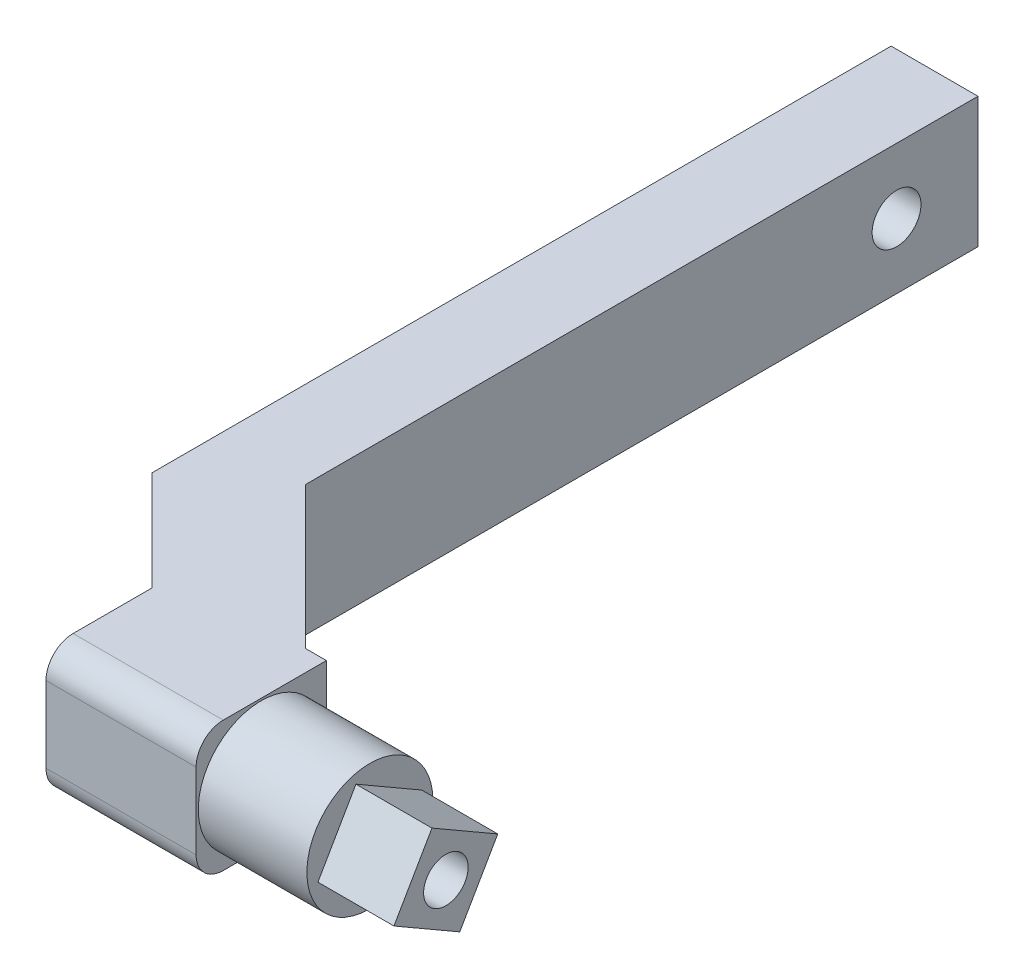
ISO-10303-21;
HEADER;
FILE_DESCRIPTION(('STEP AP214'),'2;1');
FILE_NAME('part.step','',(''),(''),'','','');
FILE_SCHEMA(('AUTOMOTIVE_DESIGN { 1 0 10303 214 1 1 1 1 }'));
ENDSEC;
DATA;
#1=APPLICATION_CONTEXT('core data for automotive mechanical design processes');
#2=APPLICATION_PROTOCOL_DEFINITION('international standard','automotive_design',2000,#1);
#3=PRODUCT_CONTEXT('',#1,'mechanical');
#4=PRODUCT('Part','Part','',(#3));
#5=PRODUCT_RELATED_PRODUCT_CATEGORY('part','',(#4));
#6=PRODUCT_DEFINITION_FORMATION('','',#4);
#7=PRODUCT_DEFINITION_CONTEXT('part definition',#1,'design');
#8=PRODUCT_DEFINITION('design','',#6,#7);
#9=PRODUCT_DEFINITION_SHAPE('','',#8);
#10=(LENGTH_UNIT() NAMED_UNIT(*) SI_UNIT(.MILLI.,.METRE.));
#11=(NAMED_UNIT(*) PLANE_ANGLE_UNIT() SI_UNIT($,.RADIAN.));
#12=(NAMED_UNIT(*) SI_UNIT($,.STERADIAN.) SOLID_ANGLE_UNIT());
#13=UNCERTAINTY_MEASURE_WITH_UNIT(LENGTH_MEASURE(1.E-05),#10,'distance_accuracy_value','');
#14=(GEOMETRIC_REPRESENTATION_CONTEXT(3) GLOBAL_UNCERTAINTY_ASSIGNED_CONTEXT((#13)) GLOBAL_UNIT_ASSIGNED_CONTEXT((#10,
#11,#12)) REPRESENTATION_CONTEXT('',''));
#15=CARTESIAN_POINT('',(0.,0.,0.));
#16=DIRECTION('',(0.,0.,1.));
#17=DIRECTION('',(1.,0.,0.));
#18=AXIS2_PLACEMENT_3D('',#15,#16,#17);
#19=CARTESIAN_POINT('',(14.,24.,0.));
#20=DIRECTION('',(-1.,0.,0.));
#21=DIRECTION('',(0.,0.,1.));
#22=AXIS2_PLACEMENT_3D('',#19,#20,#21);
#23=PLANE('',#22);
#24=CARTESIAN_POINT('',(14.,12.,2.14213562373101));
#25=DIRECTION('',(1.,0.,0.));
#26=DIRECTION('',(0.,0.,-1.));
#27=AXIS2_PLACEMENT_3D('',#24,#25,#26);
#28=CIRCLE('',#27,11.6);
#29=CARTESIAN_POINT('',(14.,12.,-9.45786437626898));
#30=VERTEX_POINT('',#29);
#31=EDGE_CURVE('E167',#30,#30,#28,.T.);
#32=ORIENTED_EDGE('',*,*,#31,.T.);
#33=EDGE_LOOP('',(#32));
#34=FACE_BOUND('',#33,.T.);
#35=DIRECTION('',(0.,0.500000000000003,0.866025403784437));
#36=VECTOR('',#35,1.);
#37=CARTESIAN_POINT('',(14.,21.5621778264911,4.70431345022204));
#38=LINE('',#37,#36);
#39=CARTESIAN_POINT('',(14.,14.562177826491,-7.42004220276007));
#40=VERTEX_POINT('',#39);
#41=CARTESIAN_POINT('',(14.,21.5621778264911,4.70431345022204));
#42=VERTEX_POINT('',#41);
#43=EDGE_CURVE('E163',#40,#42,#38,.T.);
#44=ORIENTED_EDGE('',*,*,#43,.F.);
#45=DIRECTION('',(0.,0.866025403784436,-0.500000000000004));
#46=VECTOR('',#45,1.);
#47=CARTESIAN_POINT('',(14.,14.562177826491,-7.42004220276007));
#48=LINE('',#47,#46);
#49=CARTESIAN_POINT('',(14.,2.43782217350892,-0.420042202760013));
#50=VERTEX_POINT('',#49);
#51=EDGE_CURVE('E160',#50,#40,#48,.T.);
#52=ORIENTED_EDGE('',*,*,#51,.F.);
#53=DIRECTION('',(0.,-0.500000000000004,-0.866025403784436));
#54=VECTOR('',#53,1.);
#55=CARTESIAN_POINT('',(14.,9.43782217350897,11.7043134502221));
#56=LINE('',#55,#54);
#57=CARTESIAN_POINT('',(14.,9.43782217350899,11.7043134502221));
#58=VERTEX_POINT('',#57);
#59=EDGE_CURVE('E56',#58,#50,#56,.T.);
#60=ORIENTED_EDGE('',*,*,#59,.F.);
#61=DIRECTION('',(0.,-0.866025403784436,0.500000000000004));
#62=VECTOR('',#61,1.);
#63=CARTESIAN_POINT('',(14.,21.5621778264911,4.70431345022204));
#64=LINE('',#63,#62);
#65=EDGE_CURVE('E51',#42,#58,#64,.T.);
#66=ORIENTED_EDGE('',*,*,#65,.F.);
#67=EDGE_LOOP('',(#44,#52,#60,#66));
#68=FACE_BOUND('',#67,.T.);
#69=ADVANCED_FACE('F35',(#34,#68),#23,.F.);
#70=CARTESIAN_POINT('',(-5.98849367254463E-13,24.,14.1421356237333));
#71=DIRECTION('',(0.,0.,-1.));
#72=DIRECTION('',(-1.,0.,0.));
#73=AXIS2_PLACEMENT_3D('',#70,#71,#72);
#74=PLANE('',#73);
#75=DIRECTION('',(0.,-1.,0.));
#76=VECTOR('',#75,1.);
#77=CARTESIAN_POINT('',(-33.6421356237309,24.,14.1421356237318));
#78=LINE('',#77,#76);
#79=CARTESIAN_POINT('',(-33.6421356237309,19.,14.1421356237318));
#80=VERTEX_POINT('',#79);
#81=CARTESIAN_POINT('',(-33.6421356237309,5.,14.1421356237318));
#82=VERTEX_POINT('',#81);
#83=EDGE_CURVE('E209',#80,#82,#78,.T.);
#84=ORIENTED_EDGE('',*,*,#83,.T.);
#85=DIRECTION('',(1.,0.,0.));
#86=VECTOR('',#85,1.);
#87=CARTESIAN_POINT('',(-5.98849367254463E-13,5.,14.1421356237333));
#88=LINE('',#87,#86);
#89=CARTESIAN_POINT('',(-6.,5.,14.142135623731));
#90=VERTEX_POINT('',#89);
#91=EDGE_CURVE('E245',#82,#90,#88,.T.);
#92=ORIENTED_EDGE('',*,*,#91,.T.);
#93=DIRECTION('',(0.,-1.,0.));
#94=VECTOR('',#93,1.);
#95=CARTESIAN_POINT('',(-6.,0.,14.142135623731));
#96=LINE('',#95,#94);
#97=CARTESIAN_POINT('',(-6.,19.,14.142135623731));
#98=VERTEX_POINT('',#97);
#99=EDGE_CURVE('E176',#98,#90,#96,.T.);
#100=ORIENTED_EDGE('',*,*,#99,.F.);
#101=DIRECTION('',(1.,0.,0.));
#102=VECTOR('',#101,1.);
#103=CARTESIAN_POINT('',(-33.6421356237309,19.,14.1421356237318));
#104=LINE('',#103,#102);
#105=EDGE_CURVE('E243',#98,#80,#104,.F.);
#106=ORIENTED_EDGE('',*,*,#105,.T.);
#107=EDGE_LOOP('',(#84,#92,#100,#106));
#108=FACE_BOUND('',#107,.T.);
#109=ADVANCED_FACE('F266',(#108),#74,.F.);
#110=CARTESIAN_POINT('',(0.,24.,-9.857864376269));
#111=DIRECTION('',(0.,0.,-1.));
#112=DIRECTION('',(-1.,0.,0.));
#113=AXIS2_PLACEMENT_3D('',#110,#111,#112);
#114=PLANE('',#113);
#115=DIRECTION('',(1.,0.,0.));
#116=VECTOR('',#115,1.);
#117=CARTESIAN_POINT('',(0.,24.,-9.857864376269));
#118=LINE('',#117,#116);
#119=CARTESIAN_POINT('',(-9.85786437626935,24.,-9.857864376269));
#120=VERTEX_POINT('',#119);
#121=CARTESIAN_POINT('',(-5.99999999999997,24.,-9.85786437626902));
#122=VERTEX_POINT('',#121);
#123=EDGE_CURVE('E189',#120,#122,#118,.T.);
#124=ORIENTED_EDGE('',*,*,#123,.T.);
#125=DIRECTION('',(0.,1.,0.));
#126=VECTOR('',#125,1.);
#127=CARTESIAN_POINT('',(-5.99999999999997,0.,-9.85786437626902));
#128=LINE('',#127,#126);
#129=CARTESIAN_POINT('',(-5.99999999999997,0.,-9.85786437626902));
#130=VERTEX_POINT('',#129);
#131=EDGE_CURVE('E181',#130,#122,#128,.T.);
#132=ORIENTED_EDGE('',*,*,#131,.F.);
#133=DIRECTION('',(1.,0.,0.));
#134=VECTOR('',#133,1.);
#135=CARTESIAN_POINT('',(0.,0.,-9.857864376269));
#136=LINE('',#135,#134);
#137=CARTESIAN_POINT('',(-9.85786437626935,0.,-9.857864376269));
#138=VERTEX_POINT('',#137);
#139=EDGE_CURVE('E186',#138,#130,#136,.T.);
#140=ORIENTED_EDGE('',*,*,#139,.F.);
#141=DIRECTION('',(0.,-1.,0.));
#142=VECTOR('',#141,1.);
#143=CARTESIAN_POINT('',(-9.85786437626935,24.,-9.857864376269));
#144=LINE('',#143,#142);
#145=EDGE_CURVE('E241',#120,#138,#144,.T.);
#146=ORIENTED_EDGE('',*,*,#145,.F.);
#147=EDGE_LOOP('',(#124,#132,#140,#146));
#148=FACE_BOUND('',#147,.T.);
#149=ADVANCED_FACE('F280',(#148),#114,.T.);
#150=CARTESIAN_POINT('',(0.,24.,0.));
#151=DIRECTION('',(0.,1.,0.));
#152=DIRECTION('',(0.,0.,1.));
#153=AXIS2_PLACEMENT_3D('',#150,#151,#152);
#154=PLANE('',#153);
#155=DIRECTION('',(0.,0.,1.));
#156=VECTOR('',#155,1.);
#157=CARTESIAN_POINT('',(-33.6421356237305,24.,-8.97843114592054E-13));
#158=LINE('',#157,#156);
#159=CARTESIAN_POINT('',(-33.6421356237304,24.,-5.35786437626736));
#160=VERTEX_POINT('',#159);
#161=CARTESIAN_POINT('',(-33.6421356237308,24.,9.14213562373183));
#162=VERTEX_POINT('',#161);
#163=EDGE_CURVE('E206',#160,#162,#158,.T.);
#164=ORIENTED_EDGE('',*,*,#163,.T.);
#165=DIRECTION('',(1.,0.,0.));
#166=VECTOR('',#165,1.);
#167=CARTESIAN_POINT('',(-5.99999999999979,24.,9.142135623733));
#168=LINE('',#167,#166);
#169=CARTESIAN_POINT('',(-5.99999999999999,24.,9.142135623733));
#170=VERTEX_POINT('',#169);
#171=EDGE_CURVE('E11',#162,#170,#168,.T.);
#172=ORIENTED_EDGE('',*,*,#171,.T.);
#173=DIRECTION('',(0.,0.,1.));
#174=VECTOR('',#173,1.);
#175=CARTESIAN_POINT('',(-5.99999999999998,24.,0.));
#176=LINE('',#175,#174);
#177=EDGE_CURVE('E183',#122,#170,#176,.T.);
#178=ORIENTED_EDGE('',*,*,#177,.F.);
#179=ORIENTED_EDGE('',*,*,#123,.F.);
#180=DIRECTION('',(-0.70710678118656,0.,-0.707106781186535));
#181=VECTOR('',#180,1.);
#182=CARTESIAN_POINT('',(0.,24.,0.));
#183=LINE('',#182,#181);
#184=CARTESIAN_POINT('',(-35.9999999999993,24.,-35.999999999998));
#185=VERTEX_POINT('',#184);
#186=EDGE_CURVE('E192',#120,#185,#183,.T.);
#187=ORIENTED_EDGE('',*,*,#186,.T.);
#188=DIRECTION('',(0.,0.,-1.));
#189=VECTOR('',#188,1.);
#190=CARTESIAN_POINT('',(-35.9999999999993,24.,0.));
#191=LINE('',#190,#189);
#192=CARTESIAN_POINT('',(-35.9999999999993,24.,-159.857864376267));
#193=VERTEX_POINT('',#192);
#194=EDGE_CURVE('E195',#185,#193,#191,.T.);
#195=ORIENTED_EDGE('',*,*,#194,.T.);
#196=DIRECTION('',(1.,0.,0.));
#197=VECTOR('',#196,1.);
#198=CARTESIAN_POINT('',(-2.77309190153028E-13,24.,-159.857864376267));
#199=LINE('',#198,#197);
#200=CARTESIAN_POINT('',(-51.9999999999993,24.,-159.857864376267));
#201=VERTEX_POINT('',#200);
#202=EDGE_CURVE('E197',#201,#193,#199,.T.);
#203=ORIENTED_EDGE('',*,*,#202,.F.);
#204=DIRECTION('',(0.,0.,-1.));
#205=VECTOR('',#204,1.);
#206=CARTESIAN_POINT('',(-51.9999999999992,24.,0.));
#207=LINE('',#206,#205);
#208=CARTESIAN_POINT('',(-51.9999999999992,24.,-23.715728752536));
#209=VERTEX_POINT('',#208);
#210=EDGE_CURVE('E200',#209,#201,#207,.T.);
#211=ORIENTED_EDGE('',*,*,#210,.F.);
#212=DIRECTION('',(-0.707106781186552,0.,-0.707106781186544));
#213=VECTOR('',#212,1.);
#214=CARTESIAN_POINT('',(-14.1421356237313,24.,14.1421356237315));
#215=LINE('',#214,#213);
#216=EDGE_CURVE('E203',#160,#209,#215,.T.);
#217=ORIENTED_EDGE('',*,*,#216,.F.);
#218=EDGE_LOOP('',(#164,#172,#178,#179,#187,#195,#203,#211,#217));
#219=FACE_BOUND('',#218,.T.);
#220=ADVANCED_FACE('F285',(#219),#154,.T.);
#221=CARTESIAN_POINT('',(0.,0.,0.));
#222=DIRECTION('',(0.,1.,0.));
#223=DIRECTION('',(0.,0.,1.));
#224=AXIS2_PLACEMENT_3D('',#221,#222,#223);
#225=PLANE('',#224);
#226=DIRECTION('',(0.,0.,-1.));
#227=VECTOR('',#226,1.);
#228=CARTESIAN_POINT('',(-5.99999999999998,0.,0.));
#229=LINE('',#228,#227);
#230=CARTESIAN_POINT('',(-5.99999999999999,0.,9.142135623733));
#231=VERTEX_POINT('',#230);
#232=EDGE_CURVE('E179',#231,#130,#229,.T.);
#233=ORIENTED_EDGE('',*,*,#232,.F.);
#234=DIRECTION('',(1.,0.,0.));
#235=VECTOR('',#234,1.);
#236=CARTESIAN_POINT('',(-3.87124143007046E-13,0.,9.14213562373326));
#237=LINE('',#236,#235);
#238=CARTESIAN_POINT('',(-33.6421356237308,0.,9.14213562373183));
#239=VERTEX_POINT('',#238);
#240=EDGE_CURVE('E252',#231,#239,#237,.F.);
#241=ORIENTED_EDGE('',*,*,#240,.T.);
#242=DIRECTION('',(0.,0.,1.));
#243=VECTOR('',#242,1.);
#244=CARTESIAN_POINT('',(-33.6421356237305,0.,-8.97843114592054E-13));
#245=LINE('',#244,#243);
#246=CARTESIAN_POINT('',(-33.6421356237304,0.,-5.35786437626736));
#247=VERTEX_POINT('',#246);
#248=EDGE_CURVE('E193',#247,#239,#245,.T.);
#249=ORIENTED_EDGE('',*,*,#248,.F.);
#250=DIRECTION('',(-0.707106781186552,0.,-0.707106781186544));
#251=VECTOR('',#250,1.);
#252=CARTESIAN_POINT('',(-14.1421356237313,0.,14.1421356237315));
#253=LINE('',#252,#251);
#254=CARTESIAN_POINT('',(-51.9999999999992,0.,-23.715728752536));
#255=VERTEX_POINT('',#254);
#256=EDGE_CURVE('E223',#247,#255,#253,.T.);
#257=ORIENTED_EDGE('',*,*,#256,.T.);
#258=DIRECTION('',(0.,0.,-1.));
#259=VECTOR('',#258,1.);
#260=CARTESIAN_POINT('',(-51.9999999999992,0.,0.));
#261=LINE('',#260,#259);
#262=CARTESIAN_POINT('',(-51.9999999999993,0.,-159.857864376267));
#263=VERTEX_POINT('',#262);
#264=EDGE_CURVE('E220',#255,#263,#261,.T.);
#265=ORIENTED_EDGE('',*,*,#264,.T.);
#266=DIRECTION('',(1.,0.,0.));
#267=VECTOR('',#266,1.);
#268=CARTESIAN_POINT('',(-2.77309190153028E-13,0.,-159.857864376267));
#269=LINE('',#268,#267);
#270=CARTESIAN_POINT('',(-35.9999999999993,0.,-159.857864376267));
#271=VERTEX_POINT('',#270);
#272=EDGE_CURVE('E217',#263,#271,#269,.T.);
#273=ORIENTED_EDGE('',*,*,#272,.T.);
#274=DIRECTION('',(0.,0.,-1.));
#275=VECTOR('',#274,1.);
#276=CARTESIAN_POINT('',(-35.9999999999993,0.,0.));
#277=LINE('',#276,#275);
#278=CARTESIAN_POINT('',(-35.9999999999993,0.,-35.999999999998));
#279=VERTEX_POINT('',#278);
#280=EDGE_CURVE('E214',#279,#271,#277,.T.);
#281=ORIENTED_EDGE('',*,*,#280,.F.);
#282=DIRECTION('',(-0.70710678118656,0.,-0.707106781186535));
#283=VECTOR('',#282,1.);
#284=CARTESIAN_POINT('',(0.,0.,0.));
#285=LINE('',#284,#283);
#286=EDGE_CURVE('E212',#138,#279,#285,.T.);
#287=ORIENTED_EDGE('',*,*,#286,.F.);
#288=ORIENTED_EDGE('',*,*,#139,.T.);
#289=EDGE_LOOP('',(#233,#241,#249,#257,#265,#273,#281,#287,#288));
#290=FACE_BOUND('',#289,.T.);
#291=ADVANCED_FACE('F275',(#290),#225,.F.);
#292=CARTESIAN_POINT('',(0.,24.,0.));
#293=DIRECTION('',(-0.707106781186535,0.,0.70710678118656));
#294=DIRECTION('',(0.70710678118656,0.,0.707106781186535));
#295=AXIS2_PLACEMENT_3D('',#292,#293,#294);
#296=PLANE('',#295);
#297=ORIENTED_EDGE('',*,*,#286,.T.);
#298=DIRECTION('',(0.,-1.,0.));
#299=VECTOR('',#298,1.);
#300=CARTESIAN_POINT('',(-35.9999999999993,24.,-35.999999999998));
#301=LINE('',#300,#299);
#302=EDGE_CURVE('E238',#185,#279,#301,.T.);
#303=ORIENTED_EDGE('',*,*,#302,.F.);
#304=ORIENTED_EDGE('',*,*,#186,.F.);
#305=ORIENTED_EDGE('',*,*,#145,.T.);
#306=EDGE_LOOP('',(#297,#303,#304,#305));
#307=FACE_BOUND('',#306,.T.);
#308=ADVANCED_FACE('F307',(#307),#296,.F.);
#309=CARTESIAN_POINT('',(-35.9999999999993,24.,0.));
#310=DIRECTION('',(-1.,0.,0.));
#311=DIRECTION('',(0.,0.,1.));
#312=AXIS2_PLACEMENT_3D('',#309,#310,#311);
#313=PLANE('',#312);
#314=CARTESIAN_POINT('',(-35.9999999999993,12.,-144.857864376268));
#315=DIRECTION('',(-1.,0.,0.));
#316=DIRECTION('',(0.,0.,1.));
#317=AXIS2_PLACEMENT_3D('',#314,#315,#316);
#318=CIRCLE('',#317,4.49999999999999);
#319=CARTESIAN_POINT('',(-35.9999999999993,12.,-140.357864376268));
#320=VERTEX_POINT('',#319);
#321=EDGE_CURVE('E39',#320,#320,#318,.T.);
#322=ORIENTED_EDGE('',*,*,#321,.T.);
#323=EDGE_LOOP('',(#322));
#324=FACE_BOUND('',#323,.T.);
#325=ORIENTED_EDGE('',*,*,#280,.T.);
#326=DIRECTION('',(0.,-1.,0.));
#327=VECTOR('',#326,1.);
#328=CARTESIAN_POINT('',(-35.9999999999993,24.,-159.857864376267));
#329=LINE('',#328,#327);
#330=EDGE_CURVE('E236',#193,#271,#329,.T.);
#331=ORIENTED_EDGE('',*,*,#330,.F.);
#332=ORIENTED_EDGE('',*,*,#194,.F.);
#333=ORIENTED_EDGE('',*,*,#302,.T.);
#334=EDGE_LOOP('',(#325,#331,#332,#333));
#335=FACE_BOUND('',#334,.T.);
#336=ADVANCED_FACE('F304',(#324,#335),#313,.F.);
#337=CARTESIAN_POINT('',(-2.77309190153028E-13,24.,-159.857864376267));
#338=DIRECTION('',(0.,0.,-1.));
#339=DIRECTION('',(-1.,0.,0.));
#340=AXIS2_PLACEMENT_3D('',#337,#338,#339);
#341=PLANE('',#340);
#342=ORIENTED_EDGE('',*,*,#272,.F.);
#343=DIRECTION('',(0.,-1.,0.));
#344=VECTOR('',#343,1.);
#345=CARTESIAN_POINT('',(-51.9999999999993,24.,-159.857864376267));
#346=LINE('',#345,#344);
#347=EDGE_CURVE('E234',#201,#263,#346,.T.);
#348=ORIENTED_EDGE('',*,*,#347,.F.);
#349=ORIENTED_EDGE('',*,*,#202,.T.);
#350=ORIENTED_EDGE('',*,*,#330,.T.);
#351=EDGE_LOOP('',(#342,#348,#349,#350));
#352=FACE_BOUND('',#351,.T.);
#353=ADVANCED_FACE('F300',(#352),#341,.T.);
#354=CARTESIAN_POINT('',(-51.9999999999992,24.,0.));
#355=DIRECTION('',(-1.,0.,0.));
#356=DIRECTION('',(0.,0.,1.));
#357=AXIS2_PLACEMENT_3D('',#354,#355,#356);
#358=PLANE('',#357);
#359=CARTESIAN_POINT('',(-51.9999999999981,12.,-144.857864376268));
#360=DIRECTION('',(-1.,0.,0.));
#361=DIRECTION('',(0.,0.,1.));
#362=AXIS2_PLACEMENT_3D('',#359,#360,#361);
#363=CIRCLE('',#362,11.1);
#364=CARTESIAN_POINT('',(-51.9999999999982,12.,-133.757864376268));
#365=VERTEX_POINT('',#364);
#366=EDGE_CURVE('E488',#365,#365,#363,.T.);
#367=ORIENTED_EDGE('',*,*,#366,.F.);
#368=EDGE_LOOP('',(#367));
#369=FACE_BOUND('',#368,.T.);
#370=ORIENTED_EDGE('',*,*,#264,.F.);
#371=DIRECTION('',(0.,-1.,0.));
#372=VECTOR('',#371,1.);
#373=CARTESIAN_POINT('',(-51.9999999999992,24.,-23.715728752536));
#374=LINE('',#373,#372);
#375=EDGE_CURVE('E232',#209,#255,#374,.T.);
#376=ORIENTED_EDGE('',*,*,#375,.F.);
#377=ORIENTED_EDGE('',*,*,#210,.T.);
#378=ORIENTED_EDGE('',*,*,#347,.T.);
#379=EDGE_LOOP('',(#370,#376,#377,#378));
#380=FACE_BOUND('',#379,.T.);
#381=ADVANCED_FACE('F298',(#369,#380),#358,.T.);
#382=CARTESIAN_POINT('',(-14.1421356237313,24.,14.1421356237315));
#383=DIRECTION('',(-0.707106781186544,0.,0.707106781186551));
#384=DIRECTION('',(0.707106781186551,0.,0.707106781186544));
#385=AXIS2_PLACEMENT_3D('',#382,#383,#384);
#386=PLANE('',#385);
#387=ORIENTED_EDGE('',*,*,#256,.F.);
#388=DIRECTION('',(0.,-1.,0.));
#389=VECTOR('',#388,1.);
#390=CARTESIAN_POINT('',(-33.6421356237304,24.,-5.35786437626736));
#391=LINE('',#390,#389);
#392=EDGE_CURVE('E230',#160,#247,#391,.T.);
#393=ORIENTED_EDGE('',*,*,#392,.F.);
#394=ORIENTED_EDGE('',*,*,#216,.T.);
#395=ORIENTED_EDGE('',*,*,#375,.T.);
#396=EDGE_LOOP('',(#387,#393,#394,#395));
#397=FACE_BOUND('',#396,.T.);
#398=ADVANCED_FACE('F294',(#397),#386,.T.);
#399=CARTESIAN_POINT('',(-33.6421356237305,24.,-8.97843114592054E-13));
#400=DIRECTION('',(1.,0.,0.));
#401=DIRECTION('',(0.,0.,-1.));
#402=AXIS2_PLACEMENT_3D('',#399,#400,#401);
#403=PLANE('',#402);
#404=CARTESIAN_POINT('',(-33.6421356237306,12.,2.14213562373096));
#405=DIRECTION('',(1.,0.,0.));
#406=DIRECTION('',(0.,0.,-1.));
#407=AXIS2_PLACEMENT_3D('',#404,#405,#406);
#408=CIRCLE('',#407,4.1);
#409=CARTESIAN_POINT('',(-33.6421356237305,12.,-1.95786437626904));
#410=VERTEX_POINT('',#409);
#411=EDGE_CURVE('E164',#410,#410,#408,.T.);
#412=ORIENTED_EDGE('',*,*,#411,.T.);
#413=EDGE_LOOP('',(#412));
#414=FACE_BOUND('',#413,.T.);
#415=ORIENTED_EDGE('',*,*,#248,.T.);
#416=CARTESIAN_POINT('',(-33.6421356237308,5.,9.14213562373183));
#417=DIRECTION('',(1.,0.,0.));
#418=DIRECTION('',(0.,0.,-1.));
#419=AXIS2_PLACEMENT_3D('',#416,#417,#418);
#420=CIRCLE('',#419,5.);
#421=EDGE_CURVE('E44',#239,#82,#420,.F.);
#422=ORIENTED_EDGE('',*,*,#421,.T.);
#423=ORIENTED_EDGE('',*,*,#83,.F.);
#424=CARTESIAN_POINT('',(-33.6421356237308,19.,9.14213562373183));
#425=DIRECTION('',(1.,0.,0.));
#426=DIRECTION('',(0.,0.,-1.));
#427=AXIS2_PLACEMENT_3D('',#424,#425,#426);
#428=CIRCLE('',#427,5.);
#429=EDGE_CURVE('E254',#80,#162,#428,.F.);
#430=ORIENTED_EDGE('',*,*,#429,.T.);
#431=ORIENTED_EDGE('',*,*,#163,.F.);
#432=ORIENTED_EDGE('',*,*,#392,.T.);
#433=EDGE_LOOP('',(#415,#422,#423,#430,#431,#432));
#434=FACE_BOUND('',#433,.T.);
#435=ADVANCED_FACE('F259',(#414,#434),#403,.F.);
#436=CARTESIAN_POINT('',(-5.99999999999998,12.,2.14213562373099));
#437=DIRECTION('',(1.,0.,0.));
#438=DIRECTION('',(0.,0.,-1.));
#439=AXIS2_PLACEMENT_3D('',#436,#437,#438);
#440=CYLINDRICAL_SURFACE('',#439,11.6);
#441=CARTESIAN_POINT('',(-5.99999999999998,12.,2.14213562373099));
#442=DIRECTION('',(1.,0.,0.));
#443=DIRECTION('',(0.,0.,-1.));
#444=AXIS2_PLACEMENT_3D('',#441,#442,#443);
#445=CIRCLE('',#444,11.6);
#446=CARTESIAN_POINT('',(-5.99999999999997,12.,-9.45786437626901));
#447=VERTEX_POINT('',#446);
#448=EDGE_CURVE('E173',#447,#447,#445,.T.);
#449=ORIENTED_EDGE('',*,*,#448,.T.);
#450=EDGE_LOOP('',(#449));
#451=FACE_BOUND('',#450,.T.);
#452=ORIENTED_EDGE('',*,*,#31,.F.);
#453=EDGE_LOOP('',(#452));
#454=FACE_BOUND('',#453,.T.);
#455=ADVANCED_FACE('F336',(#451,#454),#440,.T.);
#456=CARTESIAN_POINT('',(-5.99999999999998,0.,0.));
#457=DIRECTION('',(1.,0.,0.));
#458=DIRECTION('',(0.,0.,-1.));
#459=AXIS2_PLACEMENT_3D('',#456,#457,#458);
#460=PLANE('',#459);
#461=ORIENTED_EDGE('',*,*,#448,.F.);
#462=EDGE_LOOP('',(#461));
#463=FACE_BOUND('',#462,.T.);
#464=ORIENTED_EDGE('',*,*,#99,.T.);
#465=CARTESIAN_POINT('',(-5.99999999999999,5.,9.142135623733));
#466=DIRECTION('',(1.,0.,0.));
#467=DIRECTION('',(0.,0.,-1.));
#468=AXIS2_PLACEMENT_3D('',#465,#466,#467);
#469=CIRCLE('',#468,5.);
#470=EDGE_CURVE('E250',#90,#231,#469,.T.);
#471=ORIENTED_EDGE('',*,*,#470,.T.);
#472=ORIENTED_EDGE('',*,*,#232,.T.);
#473=ORIENTED_EDGE('',*,*,#131,.T.);
#474=ORIENTED_EDGE('',*,*,#177,.T.);
#475=CARTESIAN_POINT('',(-5.99999999999999,19.,9.142135623733));
#476=DIRECTION('',(1.,0.,0.));
#477=DIRECTION('',(0.,0.,-1.));
#478=AXIS2_PLACEMENT_3D('',#475,#476,#477);
#479=CIRCLE('',#478,5.);
#480=EDGE_CURVE('E248',#170,#98,#479,.T.);
#481=ORIENTED_EDGE('',*,*,#480,.T.);
#482=EDGE_LOOP('',(#464,#471,#472,#473,#474,#481));
#483=FACE_BOUND('',#482,.T.);
#484=ADVANCED_FACE('F272',(#463,#483),#460,.T.);
#485=CARTESIAN_POINT('',(-51.9999999999995,12.,2.14213562373094));
#486=DIRECTION('',(1.,0.,0.));
#487=DIRECTION('',(0.,0.,-1.));
#488=AXIS2_PLACEMENT_3D('',#485,#486,#487);
#489=CYLINDRICAL_SURFACE('',#488,4.1);
#490=ORIENTED_EDGE('',*,*,#411,.F.);
#491=EDGE_LOOP('',(#490));
#492=FACE_BOUND('',#491,.T.);
#493=CARTESIAN_POINT('',(28.,12.,2.14213562373101));
#494=DIRECTION('',(1.,0.,0.));
#495=DIRECTION('',(0.,0.,-1.));
#496=AXIS2_PLACEMENT_3D('',#493,#494,#495);
#497=CIRCLE('',#496,4.1);
#498=CARTESIAN_POINT('',(28.,12.,-1.95786437626899));
#499=VERTEX_POINT('',#498);
#500=EDGE_CURVE('E495',#499,#499,#497,.T.);
#501=ORIENTED_EDGE('',*,*,#500,.T.);
#502=EDGE_LOOP('',(#501));
#503=FACE_BOUND('',#502,.T.);
#504=ADVANCED_FACE('F326',(#492,#503),#489,.F.);
#505=CARTESIAN_POINT('',(-3.87124143007046E-13,5.,9.14213562373326));
#506=DIRECTION('',(1.,0.,0.));
#507=DIRECTION('',(0.,0.,-1.));
#508=AXIS2_PLACEMENT_3D('',#505,#506,#507);
#509=CYLINDRICAL_SURFACE('',#508,5.);
#510=ORIENTED_EDGE('',*,*,#421,.F.);
#511=ORIENTED_EDGE('',*,*,#240,.F.);
#512=ORIENTED_EDGE('',*,*,#470,.F.);
#513=ORIENTED_EDGE('',*,*,#91,.F.);
#514=EDGE_LOOP('',(#510,#511,#512,#513));
#515=FACE_BOUND('',#514,.T.);
#516=ADVANCED_FACE('F269',(#515),#509,.T.);
#517=CARTESIAN_POINT('',(-3.87124143007046E-13,19.,9.14213562373326));
#518=DIRECTION('',(-1.,0.,0.));
#519=DIRECTION('',(0.,0.,1.));
#520=AXIS2_PLACEMENT_3D('',#517,#518,#519);
#521=CYLINDRICAL_SURFACE('',#520,5.);
#522=ORIENTED_EDGE('',*,*,#429,.F.);
#523=ORIENTED_EDGE('',*,*,#105,.F.);
#524=ORIENTED_EDGE('',*,*,#480,.F.);
#525=ORIENTED_EDGE('',*,*,#171,.F.);
#526=EDGE_LOOP('',(#522,#523,#524,#525));
#527=FACE_BOUND('',#526,.T.);
#528=ADVANCED_FACE('F37',(#527),#521,.T.);
#529=CARTESIAN_POINT('',(28.,21.5621778264911,4.70431345022205));
#530=DIRECTION('',(0.,-0.866025403784437,0.500000000000003));
#531=DIRECTION('',(0.,-0.500000000000004,-0.866025403784437));
#532=AXIS2_PLACEMENT_3D('',#529,#530,#531);
#533=PLANE('',#532);
#534=ORIENTED_EDGE('',*,*,#43,.T.);
#535=DIRECTION('',(-1.,0.,0.));
#536=VECTOR('',#535,1.);
#537=CARTESIAN_POINT('',(28.,21.5621778264911,4.70431345022205));
#538=LINE('',#537,#536);
#539=CARTESIAN_POINT('',(28.,21.5621778264911,4.70431345022205));
#540=VERTEX_POINT('',#539);
#541=EDGE_CURVE('E144',#540,#42,#538,.T.);
#542=ORIENTED_EDGE('',*,*,#541,.F.);
#543=DIRECTION('',(0.,0.500000000000003,0.866025403784437));
#544=VECTOR('',#543,1.);
#545=CARTESIAN_POINT('',(28.,21.5621778264911,4.70431345022205));
#546=LINE('',#545,#544);
#547=CARTESIAN_POINT('',(28.,14.562177826491,-7.42004220276006));
#548=VERTEX_POINT('',#547);
#549=EDGE_CURVE('E151',#548,#540,#546,.T.);
#550=ORIENTED_EDGE('',*,*,#549,.F.);
#551=DIRECTION('',(-1.,0.,0.));
#552=VECTOR('',#551,1.);
#553=CARTESIAN_POINT('',(28.,14.562177826491,-7.42004220276006));
#554=LINE('',#553,#552);
#555=EDGE_CURVE('E501',#548,#40,#554,.T.);
#556=ORIENTED_EDGE('',*,*,#555,.T.);
#557=EDGE_LOOP('',(#534,#542,#550,#556));
#558=FACE_BOUND('',#557,.T.);
#559=ADVANCED_FACE('F162',(#558),#533,.F.);
#560=CARTESIAN_POINT('',(28.,21.5621778264911,4.70431345022205));
#561=DIRECTION('',(0.,-0.500000000000004,-0.866025403784436));
#562=DIRECTION('',(0.,0.866025403784436,-0.500000000000004));
#563=AXIS2_PLACEMENT_3D('',#560,#561,#562);
#564=PLANE('',#563);
#565=ORIENTED_EDGE('',*,*,#65,.T.);
#566=DIRECTION('',(-1.,0.,0.));
#567=VECTOR('',#566,1.);
#568=CARTESIAN_POINT('',(28.,9.43782217350897,11.7043134502221));
#569=LINE('',#568,#567);
#570=CARTESIAN_POINT('',(28.,9.43782217350897,11.7043134502221));
#571=VERTEX_POINT('',#570);
#572=EDGE_CURVE('E147',#571,#58,#569,.T.);
#573=ORIENTED_EDGE('',*,*,#572,.F.);
#574=DIRECTION('',(0.,-0.866025403784436,0.500000000000004));
#575=VECTOR('',#574,1.);
#576=CARTESIAN_POINT('',(28.,21.5621778264911,4.70431345022205));
#577=LINE('',#576,#575);
#578=EDGE_CURVE('E140',#540,#571,#577,.T.);
#579=ORIENTED_EDGE('',*,*,#578,.F.);
#580=ORIENTED_EDGE('',*,*,#541,.T.);
#581=EDGE_LOOP('',(#565,#573,#579,#580));
#582=FACE_BOUND('',#581,.T.);
#583=ADVANCED_FACE('F142',(#582),#564,.F.);
#584=CARTESIAN_POINT('',(28.,9.43782217350897,11.7043134502221));
#585=DIRECTION('',(0.,0.866025403784436,-0.500000000000004));
#586=DIRECTION('',(0.,0.500000000000004,0.866025403784436));
#587=AXIS2_PLACEMENT_3D('',#584,#585,#586);
#588=PLANE('',#587);
#589=ORIENTED_EDGE('',*,*,#59,.T.);
#590=DIRECTION('',(-1.,0.,0.));
#591=VECTOR('',#590,1.);
#592=CARTESIAN_POINT('',(28.,2.43782217350892,-0.420042202760004));
#593=LINE('',#592,#591);
#594=CARTESIAN_POINT('',(28.,2.43782217350892,-0.420042202760004));
#595=VERTEX_POINT('',#594);
#596=EDGE_CURVE('E169',#595,#50,#593,.T.);
#597=ORIENTED_EDGE('',*,*,#596,.F.);
#598=DIRECTION('',(0.,-0.500000000000004,-0.866025403784436));
#599=VECTOR('',#598,1.);
#600=CARTESIAN_POINT('',(28.,9.43782217350897,11.7043134502221));
#601=LINE('',#600,#599);
#602=EDGE_CURVE('E150',#571,#595,#601,.T.);
#603=ORIENTED_EDGE('',*,*,#602,.F.);
#604=ORIENTED_EDGE('',*,*,#572,.T.);
#605=EDGE_LOOP('',(#589,#597,#603,#604));
#606=FACE_BOUND('',#605,.T.);
#607=ADVANCED_FACE('F419',(#606),#588,.F.);
#608=CARTESIAN_POINT('',(28.,14.562177826491,-7.42004220276006));
#609=DIRECTION('',(0.,0.500000000000004,0.866025403784436));
#610=DIRECTION('',(0.,-0.866025403784436,0.500000000000004));
#611=AXIS2_PLACEMENT_3D('',#608,#609,#610);
#612=PLANE('',#611);
#613=ORIENTED_EDGE('',*,*,#51,.T.);
#614=ORIENTED_EDGE('',*,*,#555,.F.);
#615=DIRECTION('',(0.,0.866025403784436,-0.500000000000004));
#616=VECTOR('',#615,1.);
#617=CARTESIAN_POINT('',(28.,14.562177826491,-7.42004220276006));
#618=LINE('',#617,#616);
#619=EDGE_CURVE('E156',#595,#548,#618,.T.);
#620=ORIENTED_EDGE('',*,*,#619,.F.);
#621=ORIENTED_EDGE('',*,*,#596,.T.);
#622=EDGE_LOOP('',(#613,#614,#620,#621));
#623=FACE_BOUND('',#622,.T.);
#624=ADVANCED_FACE('F427',(#623),#612,.F.);
#625=CARTESIAN_POINT('',(28.,0.,0.));
#626=DIRECTION('',(-1.,0.,0.));
#627=DIRECTION('',(0.,0.,1.));
#628=AXIS2_PLACEMENT_3D('',#625,#626,#627);
#629=PLANE('',#628);
#630=ORIENTED_EDGE('',*,*,#500,.F.);
#631=EDGE_LOOP('',(#630));
#632=FACE_BOUND('',#631,.T.);
#633=ORIENTED_EDGE('',*,*,#549,.T.);
#634=ORIENTED_EDGE('',*,*,#578,.T.);
#635=ORIENTED_EDGE('',*,*,#602,.T.);
#636=ORIENTED_EDGE('',*,*,#619,.T.);
#637=EDGE_LOOP('',(#633,#634,#635,#636));
#638=FACE_BOUND('',#637,.T.);
#639=ADVANCED_FACE('F154',(#632,#638),#629,.F.);
#640=CARTESIAN_POINT('',(-44.8999999999981,12.,-144.857864376267));
#641=DIRECTION('',(-1.,0.,0.));
#642=DIRECTION('',(0.,0.,1.));
#643=AXIS2_PLACEMENT_3D('',#640,#641,#642);
#644=CYLINDRICAL_SURFACE('',#643,11.1);
#645=CARTESIAN_POINT('',(-44.8999999999981,12.,-144.857864376267));
#646=DIRECTION('',(-1.,0.,0.));
#647=DIRECTION('',(0.,0.,1.));
#648=AXIS2_PLACEMENT_3D('',#645,#646,#647);
#649=CIRCLE('',#648,11.1);
#650=CARTESIAN_POINT('',(-44.8999999999982,12.,-133.757864376267));
#651=VERTEX_POINT('',#650);
#652=EDGE_CURVE('E490',#651,#651,#649,.T.);
#653=ORIENTED_EDGE('',*,*,#652,.F.);
#654=EDGE_LOOP('',(#653));
#655=FACE_BOUND('',#654,.T.);
#656=ORIENTED_EDGE('',*,*,#366,.T.);
#657=EDGE_LOOP('',(#656));
#658=FACE_BOUND('',#657,.T.);
#659=ADVANCED_FACE('F449',(#655,#658),#644,.F.);
#660=CARTESIAN_POINT('',(-44.8999999999981,12.,-144.857864376267));
#661=DIRECTION('',(-1.,0.,0.));
#662=DIRECTION('',(0.,0.,1.));
#663=AXIS2_PLACEMENT_3D('',#660,#661,#662);
#664=PLANE('',#663);
#665=CARTESIAN_POINT('',(-44.8999999999981,12.,-144.857864376268));
#666=DIRECTION('',(-1.,0.,0.));
#667=DIRECTION('',(0.,0.,1.));
#668=AXIS2_PLACEMENT_3D('',#665,#666,#667);
#669=CIRCLE('',#668,4.49999999999999);
#670=CARTESIAN_POINT('',(-44.8999999999982,12.,-140.357864376268));
#671=VERTEX_POINT('',#670);
#672=EDGE_CURVE('E485',#671,#671,#669,.T.);
#673=ORIENTED_EDGE('',*,*,#672,.F.);
#674=EDGE_LOOP('',(#673));
#675=FACE_BOUND('',#674,.T.);
#676=ORIENTED_EDGE('',*,*,#652,.T.);
#677=EDGE_LOOP('',(#676));
#678=FACE_BOUND('',#677,.T.);
#679=ADVANCED_FACE('F458',(#675,#678),#664,.T.);
#680=CARTESIAN_POINT('',(28.0000000000013,12.,-144.857864376267));
#681=DIRECTION('',(-1.,0.,0.));
#682=DIRECTION('',(0.,0.,1.));
#683=AXIS2_PLACEMENT_3D('',#680,#681,#682);
#684=CYLINDRICAL_SURFACE('',#683,4.49999999999999);
#685=ORIENTED_EDGE('',*,*,#672,.T.);
#686=EDGE_LOOP('',(#685));
#687=FACE_BOUND('',#686,.T.);
#688=ORIENTED_EDGE('',*,*,#321,.F.);
#689=EDGE_LOOP('',(#688));
#690=FACE_BOUND('',#689,.T.);
#691=ADVANCED_FACE('F465',(#687,#690),#684,.F.);
#692=CLOSED_SHELL('',(#69,#109,#149,#220,#291,#308,#336,#353,#381,#398,#435,#455,#484,#504,#516,
#528,#559,#583,#607,#624,#639,#659,#679,#691));
#693=MANIFOLD_SOLID_BREP('B2',#692);
#694=ADVANCED_BREP_SHAPE_REPRESENTATION('',(#18,#693),#14);
#695=SHAPE_DEFINITION_REPRESENTATION(#9,#694);
ENDSEC;
END-ISO-10303-21;
